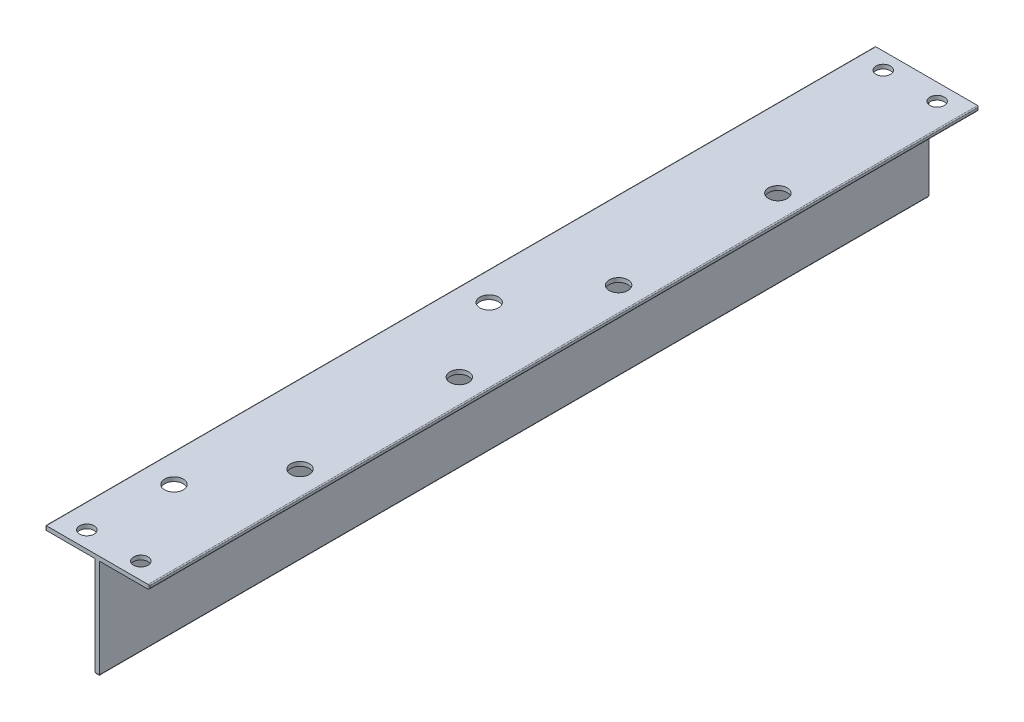
ISO-10303-21;
HEADER;
FILE_DESCRIPTION(('STEP AP214'),'2;1');
FILE_NAME('part.step','',(''),(''),'','','');
FILE_SCHEMA(('AUTOMOTIVE_DESIGN { 1 0 10303 214 1 1 1 1 }'));
ENDSEC;
DATA;
#1=APPLICATION_CONTEXT('core data for automotive mechanical design processes');
#2=APPLICATION_PROTOCOL_DEFINITION('international standard','automotive_design',2000,#1);
#3=PRODUCT_CONTEXT('',#1,'mechanical');
#4=PRODUCT('Part','Part','',(#3));
#5=PRODUCT_RELATED_PRODUCT_CATEGORY('part','',(#4));
#6=PRODUCT_DEFINITION_FORMATION('','',#4);
#7=PRODUCT_DEFINITION_CONTEXT('part definition',#1,'design');
#8=PRODUCT_DEFINITION('design','',#6,#7);
#9=PRODUCT_DEFINITION_SHAPE('','',#8);
#10=(LENGTH_UNIT() NAMED_UNIT(*) SI_UNIT(.MILLI.,.METRE.));
#11=(NAMED_UNIT(*) PLANE_ANGLE_UNIT() SI_UNIT($,.RADIAN.));
#12=(NAMED_UNIT(*) SI_UNIT($,.STERADIAN.) SOLID_ANGLE_UNIT());
#13=UNCERTAINTY_MEASURE_WITH_UNIT(LENGTH_MEASURE(1.E-05),#10,'distance_accuracy_value','');
#14=(GEOMETRIC_REPRESENTATION_CONTEXT(3) GLOBAL_UNCERTAINTY_ASSIGNED_CONTEXT((#13)) GLOBAL_UNIT_ASSIGNED_CONTEXT((#10,
#11,#12)) REPRESENTATION_CONTEXT('',''));
#15=CARTESIAN_POINT('',(0.,0.,0.));
#16=DIRECTION('',(0.,0.,1.));
#17=DIRECTION('',(1.,0.,0.));
#18=AXIS2_PLACEMENT_3D('',#15,#16,#17);
#19=CARTESIAN_POINT('',(-12.,25.,200.));
#20=DIRECTION('',(0.,-1.,0.));
#21=DIRECTION('',(0.,0.,-1.));
#22=AXIS2_PLACEMENT_3D('',#19,#20,#21);
#23=PLANE('',#22);
#24=CARTESIAN_POINT('',(7.,25.,80.8));
#25=DIRECTION('',(0.,-1.,0.));
#26=DIRECTION('',(0.,0.,-1.));
#27=AXIS2_PLACEMENT_3D('',#24,#25,#26);
#28=CIRCLE('',#27,2.25);
#29=CARTESIAN_POINT('',(7.,25.,78.55));
#30=VERTEX_POINT('',#29);
#31=EDGE_CURVE('E616',#30,#30,#28,.F.);
#32=ORIENTED_EDGE('',*,*,#31,.F.);
#33=EDGE_LOOP('',(#32));
#34=FACE_BOUND('',#33,.T.);
#35=CARTESIAN_POINT('',(7.,25.,157.6));
#36=DIRECTION('',(0.,-1.,0.));
#37=DIRECTION('',(0.,0.,-1.));
#38=AXIS2_PLACEMENT_3D('',#35,#36,#37);
#39=CIRCLE('',#38,2.25);
#40=CARTESIAN_POINT('',(7.,25.,155.35));
#41=VERTEX_POINT('',#40);
#42=EDGE_CURVE('E628',#41,#41,#39,.F.);
#43=ORIENTED_EDGE('',*,*,#42,.F.);
#44=EDGE_LOOP('',(#43));
#45=FACE_BOUND('',#44,.T.);
#46=CARTESIAN_POINT('',(-5.,25.,176.));
#47=DIRECTION('',(0.,1.,0.));
#48=DIRECTION('',(0.,0.,1.));
#49=AXIS2_PLACEMENT_3D('',#46,#47,#48);
#50=CIRCLE('',#49,2.25);
#51=CARTESIAN_POINT('',(-5.,25.,178.25));
#52=VERTEX_POINT('',#51);
#53=EDGE_CURVE('E631',#52,#52,#50,.T.);
#54=ORIENTED_EDGE('',*,*,#53,.F.);
#55=EDGE_LOOP('',(#54));
#56=FACE_BOUND('',#55,.T.);
#57=CARTESIAN_POINT('',(-5.,25.,100.));
#58=DIRECTION('',(0.,1.,0.));
#59=DIRECTION('',(0.,0.,1.));
#60=AXIS2_PLACEMENT_3D('',#57,#58,#59);
#61=CIRCLE('',#60,2.25);
#62=CARTESIAN_POINT('',(-5.,25.,102.25));
#63=VERTEX_POINT('',#62);
#64=EDGE_CURVE('E637',#63,#63,#61,.T.);
#65=ORIENTED_EDGE('',*,*,#64,.F.);
#66=EDGE_LOOP('',(#65));
#67=FACE_BOUND('',#66,.T.);
#68=CARTESIAN_POINT('',(-6.,25.,196.));
#69=DIRECTION('',(0.,-1.,0.));
#70=DIRECTION('',(0.,0.,-1.));
#71=AXIS2_PLACEMENT_3D('',#68,#69,#70);
#72=CIRCLE('',#71,1.75);
#73=CARTESIAN_POINT('',(-6.,25.,194.25));
#74=VERTEX_POINT('',#73);
#75=EDGE_CURVE('E643',#74,#74,#72,.T.);
#76=ORIENTED_EDGE('',*,*,#75,.T.);
#77=EDGE_LOOP('',(#76));
#78=FACE_BOUND('',#77,.T.);
#79=CARTESIAN_POINT('',(7.,25.,196.));
#80=DIRECTION('',(0.,-1.,0.));
#81=DIRECTION('',(0.,0.,-1.));
#82=AXIS2_PLACEMENT_3D('',#79,#80,#81);
#83=CIRCLE('',#82,1.75);
#84=CARTESIAN_POINT('',(7.,25.,194.25));
#85=VERTEX_POINT('',#84);
#86=EDGE_CURVE('E649',#85,#85,#83,.T.);
#87=ORIENTED_EDGE('',*,*,#86,.T.);
#88=EDGE_LOOP('',(#87));
#89=FACE_BOUND('',#88,.T.);
#90=CARTESIAN_POINT('',(-6.,25.,4.));
#91=DIRECTION('',(0.,-1.,0.));
#92=DIRECTION('',(0.,0.,-1.));
#93=AXIS2_PLACEMENT_3D('',#90,#91,#92);
#94=CIRCLE('',#93,1.75);
#95=CARTESIAN_POINT('',(-6.,25.,2.25));
#96=VERTEX_POINT('',#95);
#97=EDGE_CURVE('E655',#96,#96,#94,.T.);
#98=ORIENTED_EDGE('',*,*,#97,.T.);
#99=EDGE_LOOP('',(#98));
#100=FACE_BOUND('',#99,.T.);
#101=CARTESIAN_POINT('',(7.,25.,4.));
#102=DIRECTION('',(0.,-1.,0.));
#103=DIRECTION('',(0.,0.,-1.));
#104=AXIS2_PLACEMENT_3D('',#101,#102,#103);
#105=CIRCLE('',#104,1.75);
#106=CARTESIAN_POINT('',(7.,25.,2.25));
#107=VERTEX_POINT('',#106);
#108=EDGE_CURVE('E661',#107,#107,#105,.T.);
#109=ORIENTED_EDGE('',*,*,#108,.T.);
#110=EDGE_LOOP('',(#109));
#111=FACE_BOUND('',#110,.T.);
#112=DIRECTION('',(-1.,0.,0.));
#113=VECTOR('',#112,1.);
#114=CARTESIAN_POINT('',(-12.,25.,200.));
#115=LINE('',#114,#113);
#116=CARTESIAN_POINT('',(12.75,25.,200.));
#117=VERTEX_POINT('',#116);
#118=CARTESIAN_POINT('',(-11.75,25.,200.));
#119=VERTEX_POINT('',#118);
#120=EDGE_CURVE('E160',#117,#119,#115,.T.);
#121=ORIENTED_EDGE('',*,*,#120,.F.);
#122=DIRECTION('',(0.,0.,-1.));
#123=VECTOR('',#122,1.);
#124=CARTESIAN_POINT('',(12.75,25.,200.));
#125=LINE('',#124,#123);
#126=CARTESIAN_POINT('',(12.75,25.,0.));
#127=VERTEX_POINT('',#126);
#128=EDGE_CURVE('E220',#117,#127,#125,.T.);
#129=ORIENTED_EDGE('',*,*,#128,.T.);
#130=DIRECTION('',(-1.,0.,0.));
#131=VECTOR('',#130,1.);
#132=CARTESIAN_POINT('',(-12.,25.,0.));
#133=LINE('',#132,#131);
#134=CARTESIAN_POINT('',(-11.75,25.,0.));
#135=VERTEX_POINT('',#134);
#136=EDGE_CURVE('E174',#127,#135,#133,.T.);
#137=ORIENTED_EDGE('',*,*,#136,.T.);
#138=DIRECTION('',(0.,0.,-1.));
#139=VECTOR('',#138,1.);
#140=CARTESIAN_POINT('',(-11.75,25.,200.));
#141=LINE('',#140,#139);
#142=EDGE_CURVE('E217',#135,#119,#141,.F.);
#143=ORIENTED_EDGE('',*,*,#142,.T.);
#144=EDGE_LOOP('',(#121,#129,#137,#143));
#145=FACE_BOUND('',#144,.T.);
#146=CARTESIAN_POINT('',(7.,25.,119.2));
#147=DIRECTION('',(0.,-1.,0.));
#148=DIRECTION('',(0.,0.,-1.));
#149=AXIS2_PLACEMENT_3D('',#146,#147,#148);
#150=CIRCLE('',#149,2.25);
#151=CARTESIAN_POINT('',(7.,25.,116.95));
#152=VERTEX_POINT('',#151);
#153=EDGE_CURVE('E622',#152,#152,#150,.F.);
#154=ORIENTED_EDGE('',*,*,#153,.F.);
#155=EDGE_LOOP('',(#154));
#156=FACE_BOUND('',#155,.T.);
#157=CARTESIAN_POINT('',(7.,25.,42.4));
#158=DIRECTION('',(0.,-1.,0.));
#159=DIRECTION('',(0.,0.,-1.));
#160=AXIS2_PLACEMENT_3D('',#157,#158,#159);
#161=CIRCLE('',#160,2.25);
#162=CARTESIAN_POINT('',(7.,25.,40.15));
#163=VERTEX_POINT('',#162);
#164=EDGE_CURVE('E606',#163,#163,#161,.F.);
#165=ORIENTED_EDGE('',*,*,#164,.F.);
#166=EDGE_LOOP('',(#165));
#167=FACE_BOUND('',#166,.T.);
#168=ADVANCED_FACE('F31',(#34,#45,#56,#67,#78,#89,#100,#111,#145,#156,#167),#23,.F.);
#169=CARTESIAN_POINT('',(0.,24.,200.));
#170=DIRECTION('',(0.,1.,0.));
#171=DIRECTION('',(-1.,0.,0.));
#172=AXIS2_PLACEMENT_3D('',#169,#170,#171);
#173=PLANE('',#172);
#174=CARTESIAN_POINT('',(-5.,24.,100.));
#175=DIRECTION('',(0.,1.,0.));
#176=DIRECTION('',(-1.,0.,0.));
#177=AXIS2_PLACEMENT_3D('',#174,#175,#176);
#178=CIRCLE('',#177,2.25);
#179=CARTESIAN_POINT('',(-7.25,24.,100.));
#180=VERTEX_POINT('',#179);
#181=EDGE_CURVE('E640',#180,#180,#178,.F.);
#182=ORIENTED_EDGE('',*,*,#181,.F.);
#183=EDGE_LOOP('',(#182));
#184=FACE_BOUND('',#183,.T.);
#185=CARTESIAN_POINT('',(-6.,24.,196.));
#186=DIRECTION('',(0.,-1.,0.));
#187=DIRECTION('',(0.,0.,-1.));
#188=AXIS2_PLACEMENT_3D('',#185,#186,#187);
#189=CIRCLE('',#188,1.75);
#190=CARTESIAN_POINT('',(-6.,24.,194.25));
#191=VERTEX_POINT('',#190);
#192=EDGE_CURVE('E646',#191,#191,#189,.T.);
#193=ORIENTED_EDGE('',*,*,#192,.F.);
#194=EDGE_LOOP('',(#193));
#195=FACE_BOUND('',#194,.T.);
#196=CARTESIAN_POINT('',(-6.,24.,4.));
#197=DIRECTION('',(0.,-1.,0.));
#198=DIRECTION('',(0.,0.,-1.));
#199=AXIS2_PLACEMENT_3D('',#196,#197,#198);
#200=CIRCLE('',#199,1.75);
#201=CARTESIAN_POINT('',(-6.,24.,2.25));
#202=VERTEX_POINT('',#201);
#203=EDGE_CURVE('E658',#202,#202,#200,.T.);
#204=ORIENTED_EDGE('',*,*,#203,.F.);
#205=EDGE_LOOP('',(#204));
#206=FACE_BOUND('',#205,.T.);
#207=DIRECTION('',(1.,0.,0.));
#208=VECTOR('',#207,1.);
#209=CARTESIAN_POINT('',(0.,24.,200.));
#210=LINE('',#209,#208);
#211=CARTESIAN_POINT('',(-11.75,24.,200.));
#212=VERTEX_POINT('',#211);
#213=CARTESIAN_POINT('',(0.,24.,200.));
#214=VERTEX_POINT('',#213);
#215=EDGE_CURVE('E163',#212,#214,#210,.T.);
#216=ORIENTED_EDGE('',*,*,#215,.F.);
#217=DIRECTION('',(0.,0.,-1.));
#218=VECTOR('',#217,1.);
#219=CARTESIAN_POINT('',(-11.75,24.,200.));
#220=LINE('',#219,#218);
#221=CARTESIAN_POINT('',(-11.75,24.,0.));
#222=VERTEX_POINT('',#221);
#223=EDGE_CURVE('E11',#212,#222,#220,.T.);
#224=ORIENTED_EDGE('',*,*,#223,.T.);
#225=DIRECTION('',(1.,0.,0.));
#226=VECTOR('',#225,1.);
#227=CARTESIAN_POINT('',(0.,24.,0.));
#228=LINE('',#227,#226);
#229=CARTESIAN_POINT('',(0.,24.,0.));
#230=VERTEX_POINT('',#229);
#231=EDGE_CURVE('E177',#222,#230,#228,.T.);
#232=ORIENTED_EDGE('',*,*,#231,.T.);
#233=DIRECTION('',(0.,0.,-1.));
#234=VECTOR('',#233,1.);
#235=CARTESIAN_POINT('',(0.,24.,200.));
#236=LINE('',#235,#234);
#237=EDGE_CURVE('E154',#214,#230,#236,.T.);
#238=ORIENTED_EDGE('',*,*,#237,.F.);
#239=EDGE_LOOP('',(#216,#224,#232,#238));
#240=FACE_BOUND('',#239,.T.);
#241=CARTESIAN_POINT('',(-5.,24.,176.));
#242=DIRECTION('',(0.,1.,0.));
#243=DIRECTION('',(-1.,0.,0.));
#244=AXIS2_PLACEMENT_3D('',#241,#242,#243);
#245=CIRCLE('',#244,2.25);
#246=CARTESIAN_POINT('',(-7.25,24.,176.));
#247=VERTEX_POINT('',#246);
#248=EDGE_CURVE('E634',#247,#247,#245,.F.);
#249=ORIENTED_EDGE('',*,*,#248,.F.);
#250=EDGE_LOOP('',(#249));
#251=FACE_BOUND('',#250,.T.);
#252=ADVANCED_FACE('F265',(#184,#195,#206,#240,#251),#173,.F.);
#253=CARTESIAN_POINT('',(1.,0.,200.));
#254=DIRECTION('',(0.,1.,0.));
#255=DIRECTION('',(-1.,0.,0.));
#256=AXIS2_PLACEMENT_3D('',#253,#254,#255);
#257=PLANE('',#256);
#258=DIRECTION('',(1.,0.,0.));
#259=VECTOR('',#258,1.);
#260=CARTESIAN_POINT('',(1.,0.,199.75));
#261=LINE('',#260,#259);
#262=CARTESIAN_POINT('',(0.75,0.,199.75));
#263=VERTEX_POINT('',#262);
#264=CARTESIAN_POINT('',(0.25,0.,199.75));
#265=VERTEX_POINT('',#264);
#266=EDGE_CURVE('E186',#263,#265,#261,.F.);
#267=ORIENTED_EDGE('',*,*,#266,.T.);
#268=DIRECTION('',(0.,0.,-1.));
#269=VECTOR('',#268,1.);
#270=CARTESIAN_POINT('',(0.25,0.,200.));
#271=LINE('',#270,#269);
#272=CARTESIAN_POINT('',(0.25,0.,0.25));
#273=VERTEX_POINT('',#272);
#274=EDGE_CURVE('E188',#265,#273,#271,.T.);
#275=ORIENTED_EDGE('',*,*,#274,.T.);
#276=DIRECTION('',(1.,0.,0.));
#277=VECTOR('',#276,1.);
#278=CARTESIAN_POINT('',(1.,0.,0.25));
#279=LINE('',#278,#277);
#280=CARTESIAN_POINT('',(0.75,0.,0.25));
#281=VERTEX_POINT('',#280);
#282=EDGE_CURVE('E153',#273,#281,#279,.T.);
#283=ORIENTED_EDGE('',*,*,#282,.T.);
#284=DIRECTION('',(0.,0.,-1.));
#285=VECTOR('',#284,1.);
#286=CARTESIAN_POINT('',(0.75,0.,200.));
#287=LINE('',#286,#285);
#288=EDGE_CURVE('E184',#281,#263,#287,.F.);
#289=ORIENTED_EDGE('',*,*,#288,.T.);
#290=EDGE_LOOP('',(#267,#275,#283,#289));
#291=FACE_BOUND('',#290,.T.);
#292=ADVANCED_FACE('F288',(#291),#257,.F.);
#293=CARTESIAN_POINT('',(0.999999999999997,24.,200.));
#294=DIRECTION('',(-1.,0.,0.));
#295=DIRECTION('',(0.,-1.,0.));
#296=AXIS2_PLACEMENT_3D('',#293,#294,#295);
#297=PLANE('',#296);
#298=DIRECTION('',(0.,1.,0.));
#299=VECTOR('',#298,1.);
#300=CARTESIAN_POINT('',(0.999999999999997,24.,200.));
#301=LINE('',#300,#299);
#302=CARTESIAN_POINT('',(1.,0.25,200.));
#303=VERTEX_POINT('',#302);
#304=CARTESIAN_POINT('',(0.999999999999997,24.,200.));
#305=VERTEX_POINT('',#304);
#306=EDGE_CURVE('E133',#303,#305,#301,.T.);
#307=ORIENTED_EDGE('',*,*,#306,.F.);
#308=DIRECTION('',(0.,0.,-1.));
#309=VECTOR('',#308,1.);
#310=CARTESIAN_POINT('',(1.,0.25,200.));
#311=LINE('',#310,#309);
#312=CARTESIAN_POINT('',(1.,0.25,0.));
#313=VERTEX_POINT('',#312);
#314=EDGE_CURVE('E199',#303,#313,#311,.T.);
#315=ORIENTED_EDGE('',*,*,#314,.T.);
#316=DIRECTION('',(0.,1.,0.));
#317=VECTOR('',#316,1.);
#318=CARTESIAN_POINT('',(0.999999999999997,24.,0.));
#319=LINE('',#318,#317);
#320=CARTESIAN_POINT('',(0.999999999999997,24.,0.));
#321=VERTEX_POINT('',#320);
#322=EDGE_CURVE('E149',#313,#321,#319,.T.);
#323=ORIENTED_EDGE('',*,*,#322,.T.);
#324=DIRECTION('',(0.,0.,-1.));
#325=VECTOR('',#324,1.);
#326=CARTESIAN_POINT('',(0.999999999999997,24.,200.));
#327=LINE('',#326,#325);
#328=EDGE_CURVE('E146',#305,#321,#327,.T.);
#329=ORIENTED_EDGE('',*,*,#328,.F.);
#330=EDGE_LOOP('',(#307,#315,#323,#329));
#331=FACE_BOUND('',#330,.T.);
#332=ADVANCED_FACE('F147',(#331),#297,.F.);
#333=CARTESIAN_POINT('',(13.,24.,200.));
#334=DIRECTION('',(0.,1.,0.));
#335=DIRECTION('',(-1.,0.,0.));
#336=AXIS2_PLACEMENT_3D('',#333,#334,#335);
#337=PLANE('',#336);
#338=CARTESIAN_POINT('',(7.,24.,42.4));
#339=DIRECTION('',(0.,-1.,0.));
#340=DIRECTION('',(0.,0.,-1.));
#341=AXIS2_PLACEMENT_3D('',#338,#339,#340);
#342=CIRCLE('',#341,2.24999999999999);
#343=CARTESIAN_POINT('',(7.,24.,40.15));
#344=VERTEX_POINT('',#343);
#345=EDGE_CURVE('E609',#344,#344,#342,.T.);
#346=ORIENTED_EDGE('',*,*,#345,.F.);
#347=EDGE_LOOP('',(#346));
#348=FACE_BOUND('',#347,.T.);
#349=CARTESIAN_POINT('',(7.,24.,80.8));
#350=DIRECTION('',(0.,-1.,0.));
#351=DIRECTION('',(0.,0.,-1.));
#352=AXIS2_PLACEMENT_3D('',#349,#350,#351);
#353=CIRCLE('',#352,2.24999999999999);
#354=CARTESIAN_POINT('',(7.,24.,78.55));
#355=VERTEX_POINT('',#354);
#356=EDGE_CURVE('E611',#355,#355,#353,.T.);
#357=ORIENTED_EDGE('',*,*,#356,.F.);
#358=EDGE_LOOP('',(#357));
#359=FACE_BOUND('',#358,.T.);
#360=CARTESIAN_POINT('',(7.,24.,119.2));
#361=DIRECTION('',(0.,-1.,0.));
#362=DIRECTION('',(0.,0.,-1.));
#363=AXIS2_PLACEMENT_3D('',#360,#361,#362);
#364=CIRCLE('',#363,2.24999999999999);
#365=CARTESIAN_POINT('',(7.,24.,116.95));
#366=VERTEX_POINT('',#365);
#367=EDGE_CURVE('E619',#366,#366,#364,.T.);
#368=ORIENTED_EDGE('',*,*,#367,.F.);
#369=EDGE_LOOP('',(#368));
#370=FACE_BOUND('',#369,.T.);
#371=CARTESIAN_POINT('',(7.,24.,157.6));
#372=DIRECTION('',(0.,-1.,0.));
#373=DIRECTION('',(0.,0.,-1.));
#374=AXIS2_PLACEMENT_3D('',#371,#372,#373);
#375=CIRCLE('',#374,2.24999999999999);
#376=CARTESIAN_POINT('',(7.,24.,155.35));
#377=VERTEX_POINT('',#376);
#378=EDGE_CURVE('E625',#377,#377,#375,.T.);
#379=ORIENTED_EDGE('',*,*,#378,.F.);
#380=EDGE_LOOP('',(#379));
#381=FACE_BOUND('',#380,.T.);
#382=CARTESIAN_POINT('',(7.,24.,196.));
#383=DIRECTION('',(0.,-1.,0.));
#384=DIRECTION('',(0.,0.,-1.));
#385=AXIS2_PLACEMENT_3D('',#382,#383,#384);
#386=CIRCLE('',#385,1.75);
#387=CARTESIAN_POINT('',(7.,24.,194.25));
#388=VERTEX_POINT('',#387);
#389=EDGE_CURVE('E652',#388,#388,#386,.T.);
#390=ORIENTED_EDGE('',*,*,#389,.F.);
#391=EDGE_LOOP('',(#390));
#392=FACE_BOUND('',#391,.T.);
#393=CARTESIAN_POINT('',(7.,24.,4.));
#394=DIRECTION('',(0.,-1.,0.));
#395=DIRECTION('',(0.,0.,-1.));
#396=AXIS2_PLACEMENT_3D('',#393,#394,#395);
#397=CIRCLE('',#396,1.75);
#398=CARTESIAN_POINT('',(7.,24.,2.25));
#399=VERTEX_POINT('',#398);
#400=EDGE_CURVE('E249',#399,#399,#397,.T.);
#401=ORIENTED_EDGE('',*,*,#400,.F.);
#402=EDGE_LOOP('',(#401));
#403=FACE_BOUND('',#402,.T.);
#404=DIRECTION('',(1.,0.,0.));
#405=VECTOR('',#404,1.);
#406=CARTESIAN_POINT('',(13.,24.,0.));
#407=LINE('',#406,#405);
#408=CARTESIAN_POINT('',(12.75,24.,0.));
#409=VERTEX_POINT('',#408);
#410=EDGE_CURVE('E171',#321,#409,#407,.T.);
#411=ORIENTED_EDGE('',*,*,#410,.T.);
#412=DIRECTION('',(0.,0.,-1.));
#413=VECTOR('',#412,1.);
#414=CARTESIAN_POINT('',(12.75,24.,200.));
#415=LINE('',#414,#413);
#416=CARTESIAN_POINT('',(12.75,24.,200.));
#417=VERTEX_POINT('',#416);
#418=EDGE_CURVE('E159',#409,#417,#415,.F.);
#419=ORIENTED_EDGE('',*,*,#418,.T.);
#420=DIRECTION('',(1.,0.,0.));
#421=VECTOR('',#420,1.);
#422=CARTESIAN_POINT('',(13.,24.,200.));
#423=LINE('',#422,#421);
#424=EDGE_CURVE('E138',#305,#417,#423,.T.);
#425=ORIENTED_EDGE('',*,*,#424,.F.);
#426=ORIENTED_EDGE('',*,*,#328,.T.);
#427=EDGE_LOOP('',(#411,#419,#425,#426));
#428=FACE_BOUND('',#427,.T.);
#429=ADVANCED_FACE('F157',(#348,#359,#370,#381,#392,#403,#428),#337,.F.);
#430=CARTESIAN_POINT('',(13.,25.,200.));
#431=DIRECTION('',(-1.,0.,0.));
#432=DIRECTION('',(0.,-1.,0.));
#433=AXIS2_PLACEMENT_3D('',#430,#431,#432);
#434=PLANE('',#433);
#435=DIRECTION('',(0.,1.,0.));
#436=VECTOR('',#435,1.);
#437=CARTESIAN_POINT('',(13.,25.,199.75));
#438=LINE('',#437,#436);
#439=CARTESIAN_POINT('',(13.,24.75,199.75));
#440=VERTEX_POINT('',#439);
#441=CARTESIAN_POINT('',(13.,24.25,199.75));
#442=VERTEX_POINT('',#441);
#443=EDGE_CURVE('E211',#440,#442,#438,.F.);
#444=ORIENTED_EDGE('',*,*,#443,.T.);
#445=DIRECTION('',(0.,0.,-1.));
#446=VECTOR('',#445,1.);
#447=CARTESIAN_POINT('',(13.,24.25,200.));
#448=LINE('',#447,#446);
#449=CARTESIAN_POINT('',(13.,24.25,0.25));
#450=VERTEX_POINT('',#449);
#451=EDGE_CURVE('E213',#442,#450,#448,.T.);
#452=ORIENTED_EDGE('',*,*,#451,.T.);
#453=DIRECTION('',(0.,1.,0.));
#454=VECTOR('',#453,1.);
#455=CARTESIAN_POINT('',(13.,25.,0.25));
#456=LINE('',#455,#454);
#457=CARTESIAN_POINT('',(13.,24.75,0.25));
#458=VERTEX_POINT('',#457);
#459=EDGE_CURVE('E207',#450,#458,#456,.T.);
#460=ORIENTED_EDGE('',*,*,#459,.T.);
#461=DIRECTION('',(0.,0.,-1.));
#462=VECTOR('',#461,1.);
#463=CARTESIAN_POINT('',(13.,24.75,200.));
#464=LINE('',#463,#462);
#465=EDGE_CURVE('E209',#458,#440,#464,.F.);
#466=ORIENTED_EDGE('',*,*,#465,.T.);
#467=EDGE_LOOP('',(#444,#452,#460,#466));
#468=FACE_BOUND('',#467,.T.);
#469=ADVANCED_FACE('F308',(#468),#434,.F.);
#470=CARTESIAN_POINT('',(-12.,24.,200.));
#471=DIRECTION('',(1.,0.,0.));
#472=DIRECTION('',(0.,0.,-1.));
#473=AXIS2_PLACEMENT_3D('',#470,#471,#472);
#474=PLANE('',#473);
#475=DIRECTION('',(0.,-1.,0.));
#476=VECTOR('',#475,1.);
#477=CARTESIAN_POINT('',(-12.,24.,199.75));
#478=LINE('',#477,#476);
#479=CARTESIAN_POINT('',(-12.,24.25,199.75));
#480=VERTEX_POINT('',#479);
#481=CARTESIAN_POINT('',(-12.,24.75,199.75));
#482=VERTEX_POINT('',#481);
#483=EDGE_CURVE('E48',#480,#482,#478,.F.);
#484=ORIENTED_EDGE('',*,*,#483,.T.);
#485=DIRECTION('',(0.,0.,-1.));
#486=VECTOR('',#485,1.);
#487=CARTESIAN_POINT('',(-12.,24.75,200.));
#488=LINE('',#487,#486);
#489=CARTESIAN_POINT('',(-12.,24.75,0.25));
#490=VERTEX_POINT('',#489);
#491=EDGE_CURVE('E40',#482,#490,#488,.T.);
#492=ORIENTED_EDGE('',*,*,#491,.T.);
#493=DIRECTION('',(0.,-1.,0.));
#494=VECTOR('',#493,1.);
#495=CARTESIAN_POINT('',(-12.,24.,0.25));
#496=LINE('',#495,#494);
#497=CARTESIAN_POINT('',(-12.,24.25,0.25));
#498=VERTEX_POINT('',#497);
#499=EDGE_CURVE('E222',#490,#498,#496,.T.);
#500=ORIENTED_EDGE('',*,*,#499,.T.);
#501=DIRECTION('',(0.,0.,-1.));
#502=VECTOR('',#501,1.);
#503=CARTESIAN_POINT('',(-12.,24.25,200.));
#504=LINE('',#503,#502);
#505=EDGE_CURVE('E53',#498,#480,#504,.F.);
#506=ORIENTED_EDGE('',*,*,#505,.T.);
#507=EDGE_LOOP('',(#484,#492,#500,#506));
#508=FACE_BOUND('',#507,.T.);
#509=ADVANCED_FACE('F341',(#508),#474,.F.);
#510=CARTESIAN_POINT('',(0.,0.,200.));
#511=DIRECTION('',(1.,0.,0.));
#512=DIRECTION('',(0.,0.,-1.));
#513=AXIS2_PLACEMENT_3D('',#510,#511,#512);
#514=PLANE('',#513);
#515=DIRECTION('',(0.,-1.,0.));
#516=VECTOR('',#515,1.);
#517=CARTESIAN_POINT('',(0.,0.,0.));
#518=LINE('',#517,#516);
#519=CARTESIAN_POINT('',(0.,0.25,0.));
#520=VERTEX_POINT('',#519);
#521=EDGE_CURVE('E143',#230,#520,#518,.T.);
#522=ORIENTED_EDGE('',*,*,#521,.T.);
#523=DIRECTION('',(0.,0.,-1.));
#524=VECTOR('',#523,1.);
#525=CARTESIAN_POINT('',(0.,0.25,200.));
#526=LINE('',#525,#524);
#527=CARTESIAN_POINT('',(0.,0.25,200.));
#528=VERTEX_POINT('',#527);
#529=EDGE_CURVE('E191',#520,#528,#526,.F.);
#530=ORIENTED_EDGE('',*,*,#529,.T.);
#531=DIRECTION('',(0.,-1.,0.));
#532=VECTOR('',#531,1.);
#533=CARTESIAN_POINT('',(0.,0.,200.));
#534=LINE('',#533,#532);
#535=EDGE_CURVE('E168',#214,#528,#534,.T.);
#536=ORIENTED_EDGE('',*,*,#535,.F.);
#537=ORIENTED_EDGE('',*,*,#237,.T.);
#538=EDGE_LOOP('',(#522,#530,#536,#537));
#539=FACE_BOUND('',#538,.T.);
#540=ADVANCED_FACE('F275',(#539),#514,.F.);
#541=CARTESIAN_POINT('',(0.,0.,200.));
#542=DIRECTION('',(0.,0.,-1.));
#543=DIRECTION('',(-1.,0.,0.));
#544=AXIS2_PLACEMENT_3D('',#541,#542,#543);
#545=PLANE('',#544);
#546=ORIENTED_EDGE('',*,*,#535,.T.);
#547=DIRECTION('',(1.,0.,0.));
#548=VECTOR('',#547,1.);
#549=CARTESIAN_POINT('',(0.,0.25,200.));
#550=LINE('',#549,#548);
#551=EDGE_CURVE('E140',#528,#303,#550,.T.);
#552=ORIENTED_EDGE('',*,*,#551,.T.);
#553=ORIENTED_EDGE('',*,*,#306,.T.);
#554=ORIENTED_EDGE('',*,*,#424,.T.);
#555=DIRECTION('',(0.,1.,0.));
#556=VECTOR('',#555,1.);
#557=CARTESIAN_POINT('',(12.75,0.,200.));
#558=LINE('',#557,#556);
#559=EDGE_CURVE('E196',#417,#117,#558,.T.);
#560=ORIENTED_EDGE('',*,*,#559,.T.);
#561=ORIENTED_EDGE('',*,*,#120,.T.);
#562=DIRECTION('',(0.,-1.,0.));
#563=VECTOR('',#562,1.);
#564=CARTESIAN_POINT('',(-11.75,0.,200.));
#565=LINE('',#564,#563);
#566=EDGE_CURVE('E194',#119,#212,#565,.T.);
#567=ORIENTED_EDGE('',*,*,#566,.T.);
#568=ORIENTED_EDGE('',*,*,#215,.T.);
#569=EDGE_LOOP('',(#546,#552,#553,#554,#560,#561,#567,#568));
#570=FACE_BOUND('',#569,.T.);
#571=ADVANCED_FACE('F136',(#570),#545,.F.);
#572=CARTESIAN_POINT('',(0.,0.,0.));
#573=DIRECTION('',(0.,0.,-1.));
#574=DIRECTION('',(-1.,0.,0.));
#575=AXIS2_PLACEMENT_3D('',#572,#573,#574);
#576=PLANE('',#575);
#577=ORIENTED_EDGE('',*,*,#322,.F.);
#578=DIRECTION('',(1.,0.,0.));
#579=VECTOR('',#578,1.);
#580=CARTESIAN_POINT('',(0.,0.25,0.));
#581=LINE('',#580,#579);
#582=EDGE_CURVE('E205',#313,#520,#581,.F.);
#583=ORIENTED_EDGE('',*,*,#582,.T.);
#584=ORIENTED_EDGE('',*,*,#521,.F.);
#585=ORIENTED_EDGE('',*,*,#231,.F.);
#586=DIRECTION('',(0.,-1.,0.));
#587=VECTOR('',#586,1.);
#588=CARTESIAN_POINT('',(-11.75,25.,0.));
#589=LINE('',#588,#587);
#590=EDGE_CURVE('E201',#222,#135,#589,.F.);
#591=ORIENTED_EDGE('',*,*,#590,.T.);
#592=ORIENTED_EDGE('',*,*,#136,.F.);
#593=DIRECTION('',(0.,1.,0.));
#594=VECTOR('',#593,1.);
#595=CARTESIAN_POINT('',(12.75,24.,0.));
#596=LINE('',#595,#594);
#597=EDGE_CURVE('E203',#127,#409,#596,.F.);
#598=ORIENTED_EDGE('',*,*,#597,.T.);
#599=ORIENTED_EDGE('',*,*,#410,.F.);
#600=EDGE_LOOP('',(#577,#583,#584,#585,#591,#592,#598,#599));
#601=FACE_BOUND('',#600,.T.);
#602=ADVANCED_FACE('F270',(#601),#576,.T.);
#603=CARTESIAN_POINT('',(0.75,0.25,200.));
#604=DIRECTION('',(0.,0.,-1.));
#605=DIRECTION('',(-1.,0.,0.));
#606=AXIS2_PLACEMENT_3D('',#603,#604,#605);
#607=CYLINDRICAL_SURFACE('',#606,0.25);
#608=CARTESIAN_POINT('',(0.75,0.25,0.25));
#609=DIRECTION('',(-0.707106781186547,0.,-0.707106781186547));
#610=DIRECTION('',(-0.707106781186547,0.,0.707106781186547));
#611=AXIS2_PLACEMENT_3D('',#608,#609,#610);
#612=ELLIPSE('',#611,0.353553390593274,0.25);
#613=EDGE_CURVE('E232',#313,#281,#612,.T.);
#614=ORIENTED_EDGE('',*,*,#613,.F.);
#615=ORIENTED_EDGE('',*,*,#314,.F.);
#616=CARTESIAN_POINT('',(0.75,0.25,199.75));
#617=DIRECTION('',(0.707106781186547,0.,-0.707106781186547));
#618=DIRECTION('',(-0.707106781186547,0.,-0.707106781186547));
#619=AXIS2_PLACEMENT_3D('',#616,#617,#618);
#620=ELLIPSE('',#619,0.353553390593274,0.25);
#621=EDGE_CURVE('E172',#263,#303,#620,.F.);
#622=ORIENTED_EDGE('',*,*,#621,.F.);
#623=ORIENTED_EDGE('',*,*,#288,.F.);
#624=EDGE_LOOP('',(#614,#615,#622,#623));
#625=FACE_BOUND('',#624,.T.);
#626=ADVANCED_FACE('F294',(#625),#607,.T.);
#627=CARTESIAN_POINT('',(0.,0.25,199.75));
#628=DIRECTION('',(1.,0.,0.));
#629=DIRECTION('',(0.,1.,0.));
#630=AXIS2_PLACEMENT_3D('',#627,#628,#629);
#631=CYLINDRICAL_SURFACE('',#630,0.25);
#632=ORIENTED_EDGE('',*,*,#621,.T.);
#633=ORIENTED_EDGE('',*,*,#551,.F.);
#634=CARTESIAN_POINT('',(0.25,0.25,199.75));
#635=DIRECTION('',(0.707106781186547,0.,0.707106781186547));
#636=DIRECTION('',(0.707106781186547,0.,-0.707106781186547));
#637=AXIS2_PLACEMENT_3D('',#634,#635,#636);
#638=ELLIPSE('',#637,0.353553390593274,0.25);
#639=EDGE_CURVE('E229',#265,#528,#638,.F.);
#640=ORIENTED_EDGE('',*,*,#639,.F.);
#641=ORIENTED_EDGE('',*,*,#266,.F.);
#642=EDGE_LOOP('',(#632,#633,#640,#641));
#643=FACE_BOUND('',#642,.T.);
#644=ADVANCED_FACE('F292',(#643),#631,.T.);
#645=CARTESIAN_POINT('',(1.,0.249999999999999,0.25));
#646=DIRECTION('',(-1.,0.,0.));
#647=DIRECTION('',(0.,-1.,0.));
#648=AXIS2_PLACEMENT_3D('',#645,#646,#647);
#649=CYLINDRICAL_SURFACE('',#648,0.25);
#650=ORIENTED_EDGE('',*,*,#613,.T.);
#651=ORIENTED_EDGE('',*,*,#282,.F.);
#652=CARTESIAN_POINT('',(0.25,0.25,0.25));
#653=DIRECTION('',(-0.707106781186547,0.,0.707106781186547));
#654=DIRECTION('',(-0.707106781186547,0.,-0.707106781186547));
#655=AXIS2_PLACEMENT_3D('',#652,#653,#654);
#656=ELLIPSE('',#655,0.353553390593274,0.25);
#657=EDGE_CURVE('E227',#520,#273,#656,.T.);
#658=ORIENTED_EDGE('',*,*,#657,.F.);
#659=ORIENTED_EDGE('',*,*,#582,.F.);
#660=EDGE_LOOP('',(#650,#651,#658,#659));
#661=FACE_BOUND('',#660,.T.);
#662=ADVANCED_FACE('F284',(#661),#649,.T.);
#663=CARTESIAN_POINT('',(0.25,0.25,200.));
#664=DIRECTION('',(0.,0.,-1.));
#665=DIRECTION('',(-1.,0.,0.));
#666=AXIS2_PLACEMENT_3D('',#663,#664,#665);
#667=CYLINDRICAL_SURFACE('',#666,0.25);
#668=ORIENTED_EDGE('',*,*,#639,.T.);
#669=ORIENTED_EDGE('',*,*,#529,.F.);
#670=ORIENTED_EDGE('',*,*,#657,.T.);
#671=ORIENTED_EDGE('',*,*,#274,.F.);
#672=EDGE_LOOP('',(#668,#669,#670,#671));
#673=FACE_BOUND('',#672,.T.);
#674=ADVANCED_FACE('F279',(#673),#667,.T.);
#675=CARTESIAN_POINT('',(12.75,24.75,200.));
#676=DIRECTION('',(0.,0.,-1.));
#677=DIRECTION('',(-1.,0.,0.));
#678=AXIS2_PLACEMENT_3D('',#675,#676,#677);
#679=CYLINDRICAL_SURFACE('',#678,0.25);
#680=CARTESIAN_POINT('',(12.75,24.75,0.25));
#681=DIRECTION('',(0.,-0.707106781186547,-0.707106781186547));
#682=DIRECTION('',(0.,-0.707106781186547,0.707106781186547));
#683=AXIS2_PLACEMENT_3D('',#680,#681,#682);
#684=ELLIPSE('',#683,0.353553390593274,0.25);
#685=EDGE_CURVE('E241',#127,#458,#684,.T.);
#686=ORIENTED_EDGE('',*,*,#685,.F.);
#687=ORIENTED_EDGE('',*,*,#128,.F.);
#688=CARTESIAN_POINT('',(12.75,24.75,199.75));
#689=DIRECTION('',(0.,0.707106781186547,-0.707106781186547));
#690=DIRECTION('',(0.,-0.707106781186547,-0.707106781186547));
#691=AXIS2_PLACEMENT_3D('',#688,#689,#690);
#692=ELLIPSE('',#691,0.353553390593274,0.25);
#693=EDGE_CURVE('E230',#440,#117,#692,.F.);
#694=ORIENTED_EDGE('',*,*,#693,.F.);
#695=ORIENTED_EDGE('',*,*,#465,.F.);
#696=EDGE_LOOP('',(#686,#687,#694,#695));
#697=FACE_BOUND('',#696,.T.);
#698=ADVANCED_FACE('F319',(#697),#679,.T.);
#699=CARTESIAN_POINT('',(12.75,0.,199.75));
#700=DIRECTION('',(0.,1.,0.));
#701=DIRECTION('',(-1.,0.,0.));
#702=AXIS2_PLACEMENT_3D('',#699,#700,#701);
#703=CYLINDRICAL_SURFACE('',#702,0.25);
#704=ORIENTED_EDGE('',*,*,#693,.T.);
#705=ORIENTED_EDGE('',*,*,#559,.F.);
#706=CARTESIAN_POINT('',(12.75,24.25,199.75));
#707=DIRECTION('',(0.,0.707106781186547,0.707106781186547));
#708=DIRECTION('',(0.,0.707106781186547,-0.707106781186547));
#709=AXIS2_PLACEMENT_3D('',#706,#707,#708);
#710=ELLIPSE('',#709,0.353553390593274,0.25);
#711=EDGE_CURVE('E239',#442,#417,#710,.F.);
#712=ORIENTED_EDGE('',*,*,#711,.F.);
#713=ORIENTED_EDGE('',*,*,#443,.F.);
#714=EDGE_LOOP('',(#704,#705,#712,#713));
#715=FACE_BOUND('',#714,.T.);
#716=ADVANCED_FACE('F312',(#715),#703,.T.);
#717=CARTESIAN_POINT('',(12.75,25.,0.25));
#718=DIRECTION('',(0.,-1.,0.));
#719=DIRECTION('',(1.,0.,0.));
#720=AXIS2_PLACEMENT_3D('',#717,#718,#719);
#721=CYLINDRICAL_SURFACE('',#720,0.25);
#722=ORIENTED_EDGE('',*,*,#685,.T.);
#723=ORIENTED_EDGE('',*,*,#459,.F.);
#724=CARTESIAN_POINT('',(12.75,24.25,0.25));
#725=DIRECTION('',(0.,-0.707106781186547,0.707106781186547));
#726=DIRECTION('',(0.,-0.707106781186547,-0.707106781186547));
#727=AXIS2_PLACEMENT_3D('',#724,#725,#726);
#728=ELLIPSE('',#727,0.353553390593274,0.25);
#729=EDGE_CURVE('E237',#409,#450,#728,.T.);
#730=ORIENTED_EDGE('',*,*,#729,.F.);
#731=ORIENTED_EDGE('',*,*,#597,.F.);
#732=EDGE_LOOP('',(#722,#723,#730,#731));
#733=FACE_BOUND('',#732,.T.);
#734=ADVANCED_FACE('F304',(#733),#721,.T.);
#735=CARTESIAN_POINT('',(12.75,24.25,200.));
#736=DIRECTION('',(0.,0.,-1.));
#737=DIRECTION('',(-1.,0.,0.));
#738=AXIS2_PLACEMENT_3D('',#735,#736,#737);
#739=CYLINDRICAL_SURFACE('',#738,0.25);
#740=ORIENTED_EDGE('',*,*,#711,.T.);
#741=ORIENTED_EDGE('',*,*,#418,.F.);
#742=ORIENTED_EDGE('',*,*,#729,.T.);
#743=ORIENTED_EDGE('',*,*,#451,.F.);
#744=EDGE_LOOP('',(#740,#741,#742,#743));
#745=FACE_BOUND('',#744,.T.);
#746=ADVANCED_FACE('F298',(#745),#739,.T.);
#747=CARTESIAN_POINT('',(-11.75,24.25,200.));
#748=DIRECTION('',(0.,0.,-1.));
#749=DIRECTION('',(-1.,0.,0.));
#750=AXIS2_PLACEMENT_3D('',#747,#748,#749);
#751=CYLINDRICAL_SURFACE('',#750,0.25);
#752=CARTESIAN_POINT('',(-11.75,24.25,0.25));
#753=DIRECTION('',(0.,0.707106781186547,-0.707106781186547));
#754=DIRECTION('',(0.,0.707106781186547,0.707106781186547));
#755=AXIS2_PLACEMENT_3D('',#752,#753,#754);
#756=ELLIPSE('',#755,0.353553390593274,0.25);
#757=EDGE_CURVE('E250',#222,#498,#756,.T.);
#758=ORIENTED_EDGE('',*,*,#757,.F.);
#759=ORIENTED_EDGE('',*,*,#223,.F.);
#760=CARTESIAN_POINT('',(-11.75,24.25,199.75));
#761=DIRECTION('',(0.,-0.707106781186547,-0.707106781186547));
#762=DIRECTION('',(0.,0.707106781186547,-0.707106781186547));
#763=AXIS2_PLACEMENT_3D('',#760,#761,#762);
#764=ELLIPSE('',#763,0.353553390593274,0.25);
#765=EDGE_CURVE('E35',#480,#212,#764,.F.);
#766=ORIENTED_EDGE('',*,*,#765,.F.);
#767=ORIENTED_EDGE('',*,*,#505,.F.);
#768=EDGE_LOOP('',(#758,#759,#766,#767));
#769=FACE_BOUND('',#768,.T.);
#770=ADVANCED_FACE('F33',(#769),#751,.T.);
#771=CARTESIAN_POINT('',(-11.75,0.,199.75));
#772=DIRECTION('',(0.,-1.,0.));
#773=DIRECTION('',(0.,0.,-1.));
#774=AXIS2_PLACEMENT_3D('',#771,#772,#773);
#775=CYLINDRICAL_SURFACE('',#774,0.25);
#776=ORIENTED_EDGE('',*,*,#765,.T.);
#777=ORIENTED_EDGE('',*,*,#566,.F.);
#778=CARTESIAN_POINT('',(-11.75,24.75,199.75));
#779=DIRECTION('',(0.,-0.707106781186547,0.707106781186547));
#780=DIRECTION('',(0.,-0.707106781186547,-0.707106781186547));
#781=AXIS2_PLACEMENT_3D('',#778,#779,#780);
#782=ELLIPSE('',#781,0.353553390593274,0.25);
#783=EDGE_CURVE('E248',#482,#119,#782,.F.);
#784=ORIENTED_EDGE('',*,*,#783,.F.);
#785=ORIENTED_EDGE('',*,*,#483,.F.);
#786=EDGE_LOOP('',(#776,#777,#784,#785));
#787=FACE_BOUND('',#786,.T.);
#788=ADVANCED_FACE('F259',(#787),#775,.T.);
#789=CARTESIAN_POINT('',(-11.75,24.,0.25));
#790=DIRECTION('',(0.,1.,0.));
#791=DIRECTION('',(0.,0.,1.));
#792=AXIS2_PLACEMENT_3D('',#789,#790,#791);
#793=CYLINDRICAL_SURFACE('',#792,0.25);
#794=ORIENTED_EDGE('',*,*,#757,.T.);
#795=ORIENTED_EDGE('',*,*,#499,.F.);
#796=CARTESIAN_POINT('',(-11.75,24.75,0.25));
#797=DIRECTION('',(0.,0.707106781186547,0.707106781186547));
#798=DIRECTION('',(0.,0.707106781186547,-0.707106781186547));
#799=AXIS2_PLACEMENT_3D('',#796,#797,#798);
#800=ELLIPSE('',#799,0.353553390593274,0.25);
#801=EDGE_CURVE('E246',#135,#490,#800,.T.);
#802=ORIENTED_EDGE('',*,*,#801,.F.);
#803=ORIENTED_EDGE('',*,*,#590,.F.);
#804=EDGE_LOOP('',(#794,#795,#802,#803));
#805=FACE_BOUND('',#804,.T.);
#806=ADVANCED_FACE('F379',(#805),#793,.T.);
#807=CARTESIAN_POINT('',(-11.75,24.75,200.));
#808=DIRECTION('',(0.,0.,-1.));
#809=DIRECTION('',(-1.,0.,0.));
#810=AXIS2_PLACEMENT_3D('',#807,#808,#809);
#811=CYLINDRICAL_SURFACE('',#810,0.25);
#812=ORIENTED_EDGE('',*,*,#783,.T.);
#813=ORIENTED_EDGE('',*,*,#142,.F.);
#814=ORIENTED_EDGE('',*,*,#801,.T.);
#815=ORIENTED_EDGE('',*,*,#491,.F.);
#816=EDGE_LOOP('',(#812,#813,#814,#815));
#817=FACE_BOUND('',#816,.T.);
#818=ADVANCED_FACE('F385',(#817),#811,.T.);
#819=CARTESIAN_POINT('',(7.,24.,4.));
#820=DIRECTION('',(0.,-1.,0.));
#821=DIRECTION('',(0.,0.,-1.));
#822=AXIS2_PLACEMENT_3D('',#819,#820,#821);
#823=CYLINDRICAL_SURFACE('',#822,1.75);
#824=ORIENTED_EDGE('',*,*,#108,.F.);
#825=EDGE_LOOP('',(#824));
#826=FACE_BOUND('',#825,.T.);
#827=ORIENTED_EDGE('',*,*,#400,.T.);
#828=EDGE_LOOP('',(#827));
#829=FACE_BOUND('',#828,.T.);
#830=ADVANCED_FACE('F392',(#826,#829),#823,.F.);
#831=CARTESIAN_POINT('',(-6.,24.,4.));
#832=DIRECTION('',(0.,-1.,0.));
#833=DIRECTION('',(0.,0.,-1.));
#834=AXIS2_PLACEMENT_3D('',#831,#832,#833);
#835=CYLINDRICAL_SURFACE('',#834,1.75);
#836=ORIENTED_EDGE('',*,*,#97,.F.);
#837=EDGE_LOOP('',(#836));
#838=FACE_BOUND('',#837,.T.);
#839=ORIENTED_EDGE('',*,*,#203,.T.);
#840=EDGE_LOOP('',(#839));
#841=FACE_BOUND('',#840,.T.);
#842=ADVANCED_FACE('F399',(#838,#841),#835,.F.);
#843=CARTESIAN_POINT('',(7.,24.,196.));
#844=DIRECTION('',(0.,-1.,0.));
#845=DIRECTION('',(0.,0.,-1.));
#846=AXIS2_PLACEMENT_3D('',#843,#844,#845);
#847=CYLINDRICAL_SURFACE('',#846,1.75);
#848=ORIENTED_EDGE('',*,*,#86,.F.);
#849=EDGE_LOOP('',(#848));
#850=FACE_BOUND('',#849,.T.);
#851=ORIENTED_EDGE('',*,*,#389,.T.);
#852=EDGE_LOOP('',(#851));
#853=FACE_BOUND('',#852,.T.);
#854=ADVANCED_FACE('F407',(#850,#853),#847,.F.);
#855=CARTESIAN_POINT('',(-6.,24.,196.));
#856=DIRECTION('',(0.,-1.,0.));
#857=DIRECTION('',(0.,0.,-1.));
#858=AXIS2_PLACEMENT_3D('',#855,#856,#857);
#859=CYLINDRICAL_SURFACE('',#858,1.75);
#860=ORIENTED_EDGE('',*,*,#75,.F.);
#861=EDGE_LOOP('',(#860));
#862=FACE_BOUND('',#861,.T.);
#863=ORIENTED_EDGE('',*,*,#192,.T.);
#864=EDGE_LOOP('',(#863));
#865=FACE_BOUND('',#864,.T.);
#866=ADVANCED_FACE('F415',(#862,#865),#859,.F.);
#867=CARTESIAN_POINT('',(-5.,25.,100.));
#868=DIRECTION('',(0.,1.,0.));
#869=DIRECTION('',(0.,0.,1.));
#870=AXIS2_PLACEMENT_3D('',#867,#868,#869);
#871=CYLINDRICAL_SURFACE('',#870,2.25);
#872=ORIENTED_EDGE('',*,*,#181,.T.);
#873=EDGE_LOOP('',(#872));
#874=FACE_BOUND('',#873,.T.);
#875=ORIENTED_EDGE('',*,*,#64,.T.);
#876=EDGE_LOOP('',(#875));
#877=FACE_BOUND('',#876,.T.);
#878=ADVANCED_FACE('F423',(#874,#877),#871,.F.);
#879=CARTESIAN_POINT('',(-5.,25.,176.));
#880=DIRECTION('',(0.,1.,0.));
#881=DIRECTION('',(0.,0.,1.));
#882=AXIS2_PLACEMENT_3D('',#879,#880,#881);
#883=CYLINDRICAL_SURFACE('',#882,2.25);
#884=ORIENTED_EDGE('',*,*,#248,.T.);
#885=EDGE_LOOP('',(#884));
#886=FACE_BOUND('',#885,.T.);
#887=ORIENTED_EDGE('',*,*,#53,.T.);
#888=EDGE_LOOP('',(#887));
#889=FACE_BOUND('',#888,.T.);
#890=ADVANCED_FACE('F432',(#886,#889),#883,.F.);
#891=CARTESIAN_POINT('',(7.,24.,157.6));
#892=DIRECTION('',(0.,-1.,0.));
#893=DIRECTION('',(0.,0.,-1.));
#894=AXIS2_PLACEMENT_3D('',#891,#892,#893);
#895=CYLINDRICAL_SURFACE('',#894,2.25);
#896=ORIENTED_EDGE('',*,*,#42,.T.);
#897=EDGE_LOOP('',(#896));
#898=FACE_BOUND('',#897,.T.);
#899=ORIENTED_EDGE('',*,*,#378,.T.);
#900=EDGE_LOOP('',(#899));
#901=FACE_BOUND('',#900,.T.);
#902=ADVANCED_FACE('F440',(#898,#901),#895,.F.);
#903=CARTESIAN_POINT('',(7.,24.,119.2));
#904=DIRECTION('',(0.,-1.,0.));
#905=DIRECTION('',(0.,0.,-1.));
#906=AXIS2_PLACEMENT_3D('',#903,#904,#905);
#907=CYLINDRICAL_SURFACE('',#906,2.25);
#908=ORIENTED_EDGE('',*,*,#153,.T.);
#909=EDGE_LOOP('',(#908));
#910=FACE_BOUND('',#909,.T.);
#911=ORIENTED_EDGE('',*,*,#367,.T.);
#912=EDGE_LOOP('',(#911));
#913=FACE_BOUND('',#912,.T.);
#914=ADVANCED_FACE('F448',(#910,#913),#907,.F.);
#915=CARTESIAN_POINT('',(7.,24.,80.8));
#916=DIRECTION('',(0.,-1.,0.));
#917=DIRECTION('',(0.,0.,-1.));
#918=AXIS2_PLACEMENT_3D('',#915,#916,#917);
#919=CYLINDRICAL_SURFACE('',#918,2.25);
#920=ORIENTED_EDGE('',*,*,#31,.T.);
#921=EDGE_LOOP('',(#920));
#922=FACE_BOUND('',#921,.T.);
#923=ORIENTED_EDGE('',*,*,#356,.T.);
#924=EDGE_LOOP('',(#923));
#925=FACE_BOUND('',#924,.T.);
#926=ADVANCED_FACE('F456',(#922,#925),#919,.F.);
#927=CARTESIAN_POINT('',(7.,24.,42.4));
#928=DIRECTION('',(0.,-1.,0.));
#929=DIRECTION('',(0.,0.,-1.));
#930=AXIS2_PLACEMENT_3D('',#927,#928,#929);
#931=CYLINDRICAL_SURFACE('',#930,2.25);
#932=ORIENTED_EDGE('',*,*,#164,.T.);
#933=EDGE_LOOP('',(#932));
#934=FACE_BOUND('',#933,.T.);
#935=ORIENTED_EDGE('',*,*,#345,.T.);
#936=EDGE_LOOP('',(#935));
#937=FACE_BOUND('',#936,.T.);
#938=ADVANCED_FACE('F465',(#934,#937),#931,.F.);
#939=CLOSED_SHELL('',(#168,#252,#292,#332,#429,#469,#509,#540,#571,#602,#626,#644,#662,#674,
#698,#716,#734,#746,#770,#788,#806,#818,#830,#842,#854,#866,#878,#890,#902,#914,#926,#938));
#940=MANIFOLD_SOLID_BREP('B2',#939);
#941=ADVANCED_BREP_SHAPE_REPRESENTATION('',(#18,#940),#14);
#942=SHAPE_DEFINITION_REPRESENTATION(#9,#941);
ENDSEC;
END-ISO-10303-21;
